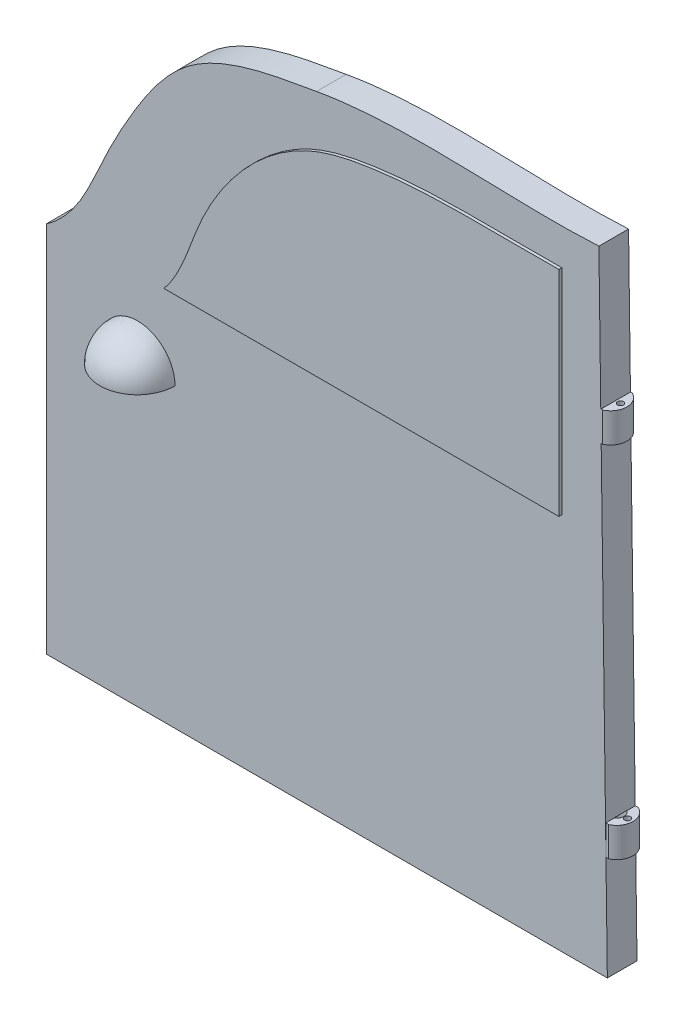
ISO-10303-21;
HEADER;
FILE_DESCRIPTION(('STEP AP214'),'2;1');
FILE_NAME('part.step','',(''),(''),'','','');
FILE_SCHEMA(('AUTOMOTIVE_DESIGN { 1 0 10303 214 1 1 1 1 }'));
ENDSEC;
DATA;
#1=APPLICATION_CONTEXT('core data for automotive mechanical design processes');
#2=APPLICATION_PROTOCOL_DEFINITION('international standard','automotive_design',2000,#1);
#3=PRODUCT_CONTEXT('',#1,'mechanical');
#4=PRODUCT('Part','Part','',(#3));
#5=PRODUCT_RELATED_PRODUCT_CATEGORY('part','',(#4));
#6=PRODUCT_DEFINITION_FORMATION('','',#4);
#7=PRODUCT_DEFINITION_CONTEXT('part definition',#1,'design');
#8=PRODUCT_DEFINITION('design','',#6,#7);
#9=PRODUCT_DEFINITION_SHAPE('','',#8);
#10=(LENGTH_UNIT() NAMED_UNIT(*) SI_UNIT(.MILLI.,.METRE.));
#11=(NAMED_UNIT(*) PLANE_ANGLE_UNIT() SI_UNIT($,.RADIAN.));
#12=(NAMED_UNIT(*) SI_UNIT($,.STERADIAN.) SOLID_ANGLE_UNIT());
#13=UNCERTAINTY_MEASURE_WITH_UNIT(LENGTH_MEASURE(1.E-05),#10,'distance_accuracy_value','');
#14=(GEOMETRIC_REPRESENTATION_CONTEXT(3) GLOBAL_UNCERTAINTY_ASSIGNED_CONTEXT((#13)) GLOBAL_UNIT_ASSIGNED_CONTEXT((#10,
#11,#12)) REPRESENTATION_CONTEXT('',''));
#15=CARTESIAN_POINT('',(0.,0.,0.));
#16=DIRECTION('',(0.,0.,1.));
#17=DIRECTION('',(1.,0.,0.));
#18=AXIS2_PLACEMENT_3D('',#15,#16,#17);
#19=CARTESIAN_POINT('',(188.575018149559,45.,0.));
#20=DIRECTION('',(1.,0.,0.));
#21=DIRECTION('',(0.,0.,-1.));
#22=AXIS2_PLACEMENT_3D('',#19,#20,#21);
#23=PLANE('',#22);
#24=DIRECTION('',(0.,0.,1.));
#25=VECTOR('',#24,1.);
#26=CARTESIAN_POINT('',(188.575018149559,41.1730352161484,10.));
#27=LINE('',#26,#25);
#28=CARTESIAN_POINT('',(188.575018149559,41.1730352161484,0.));
#29=VERTEX_POINT('',#28);
#30=CARTESIAN_POINT('',(188.575018149559,41.1730352161484,2.86242445380102));
#31=VERTEX_POINT('',#30);
#32=EDGE_CURVE('E263',#29,#31,#27,.T.);
#33=ORIENTED_EDGE('',*,*,#32,.T.);
#34=DIRECTION('',(0.,1.,0.));
#35=VECTOR('',#34,1.);
#36=CARTESIAN_POINT('',(188.575018149559,35.,2.86242445380102));
#37=LINE('',#36,#35);
#38=CARTESIAN_POINT('',(188.575018149559,45.,2.86242445380102));
#39=VERTEX_POINT('',#38);
#40=EDGE_CURVE('E382',#31,#39,#37,.T.);
#41=ORIENTED_EDGE('',*,*,#40,.T.);
#42=DIRECTION('',(0.,0.,1.));
#43=VECTOR('',#42,1.);
#44=CARTESIAN_POINT('',(188.575018149559,45.,0.));
#45=LINE('',#44,#43);
#46=CARTESIAN_POINT('',(188.575018149559,45.,0.));
#47=VERTEX_POINT('',#46);
#48=EDGE_CURVE('E300',#47,#39,#45,.T.);
#49=ORIENTED_EDGE('',*,*,#48,.F.);
#50=DIRECTION('',(0.,-1.,0.));
#51=VECTOR('',#50,1.);
#52=CARTESIAN_POINT('',(188.575018149559,45.,0.));
#53=LINE('',#52,#51);
#54=EDGE_CURVE('E286',#47,#29,#53,.T.);
#55=ORIENTED_EDGE('',*,*,#54,.T.);
#56=EDGE_LOOP('',(#33,#41,#49,#55));
#57=FACE_BOUND('',#56,.T.);
#58=ADVANCED_FACE('F53',(#57),#23,.F.);
#59=CARTESIAN_POINT('',(186.280110434595,212.216863760996,10.));
#60=DIRECTION('',(-0.999910003212435,-0.0134158665656854,0.));
#61=DIRECTION('',(0.0134158665656854,-0.999910003212435,0.));
#62=AXIS2_PLACEMENT_3D('',#59,#60,#61);
#63=PLANE('',#62);
#64=DIRECTION('',(0.,0.,1.));
#65=VECTOR('',#64,1.);
#66=CARTESIAN_POINT('',(186.972854643501,160.585322797063,10.));
#67=LINE('',#66,#65);
#68=CARTESIAN_POINT('',(186.972854643501,160.585322797063,0.));
#69=VERTEX_POINT('',#68);
#70=CARTESIAN_POINT('',(186.972854643501,160.585322797063,10.));
#71=VERTEX_POINT('',#70);
#72=EDGE_CURVE('E314',#69,#71,#67,.T.);
#73=ORIENTED_EDGE('',*,*,#72,.F.);
#74=DIRECTION('',(-0.0134158665656854,0.999910003212435,0.));
#75=VECTOR('',#74,1.);
#76=CARTESIAN_POINT('',(186.280110434595,212.216863760996,0.));
#77=LINE('',#76,#75);
#78=CARTESIAN_POINT('',(186.280110434595,212.216863760996,0.));
#79=VERTEX_POINT('',#78);
#80=EDGE_CURVE('E601',#69,#79,#77,.T.);
#81=ORIENTED_EDGE('',*,*,#80,.T.);
#82=DIRECTION('',(0.,0.,-1.));
#83=VECTOR('',#82,1.);
#84=CARTESIAN_POINT('',(186.280110434595,212.216863760996,10.));
#85=LINE('',#84,#83);
#86=CARTESIAN_POINT('',(186.280110434595,212.216863760996,10.));
#87=VERTEX_POINT('',#86);
#88=EDGE_CURVE('E576',#87,#79,#85,.T.);
#89=ORIENTED_EDGE('',*,*,#88,.F.);
#90=DIRECTION('',(-0.0134158665656854,0.999910003212435,0.));
#91=VECTOR('',#90,1.);
#92=CARTESIAN_POINT('',(186.280110434595,212.216863760996,10.));
#93=LINE('',#92,#91);
#94=EDGE_CURVE('E571',#71,#87,#93,.T.);
#95=ORIENTED_EDGE('',*,*,#94,.F.);
#96=EDGE_LOOP('',(#73,#81,#89,#95));
#97=FACE_BOUND('',#96,.T.);
#98=ADVANCED_FACE('F537',(#97),#63,.F.);
#99=DIRECTION('',(0.,0.,-1.));
#100=VECTOR('',#99,1.);
#101=CARTESIAN_POINT('',(188.523671479632,45.,10.));
#102=LINE('',#101,#100);
#103=CARTESIAN_POINT('',(188.523671479632,45.,7.14911649207953));
#104=VERTEX_POINT('',#103);
#105=CARTESIAN_POINT('',(188.523671479632,45.,2.83160382744635));
#106=VERTEX_POINT('',#105);
#107=EDGE_CURVE('E375',#104,#106,#102,.T.);
#108=ORIENTED_EDGE('',*,*,#107,.T.);
#109=CARTESIAN_POINT('',(187.26281022728,138.974382699553,4.99036015976294));
#110=DIRECTION('',(-0.999910003212435,-0.0134158665656854,0.));
#111=DIRECTION('',(-0.0134158665656854,0.999910003212435,0.));
#112=AXIS2_PLACEMENT_3D('',#109,#110,#111);
#113=ELLIPSE('',#112,186.346516474337,2.5);
#114=EDGE_CURVE('E381',#106,#31,#113,.T.);
#115=ORIENTED_EDGE('',*,*,#114,.T.);
#116=ORIENTED_EDGE('',*,*,#32,.F.);
#117=CARTESIAN_POINT('',(187.047793333114,155.,0.));
#118=VERTEX_POINT('',#117);
#119=EDGE_CURVE('E605',#29,#118,#77,.T.);
#120=ORIENTED_EDGE('',*,*,#119,.T.);
#121=DIRECTION('',(0.,0.,-1.));
#122=VECTOR('',#121,1.);
#123=CARTESIAN_POINT('',(187.047793333114,155.,10.));
#124=LINE('',#123,#122);
#125=CARTESIAN_POINT('',(187.047793333114,155.,10.));
#126=VERTEX_POINT('',#125);
#127=EDGE_CURVE('E318',#126,#118,#124,.T.);
#128=ORIENTED_EDGE('',*,*,#127,.F.);
#129=CARTESIAN_POINT('',(189.127439812298,0.,10.));
#130=VERTEX_POINT('',#129);
#131=EDGE_CURVE('E572',#130,#126,#93,.T.);
#132=ORIENTED_EDGE('',*,*,#131,.F.);
#133=DIRECTION('',(0.,0.,-1.));
#134=VECTOR('',#133,1.);
#135=CARTESIAN_POINT('',(189.127439812298,0.,10.));
#136=LINE('',#135,#134);
#137=CARTESIAN_POINT('',(189.127439812298,0.,0.));
#138=VERTEX_POINT('',#137);
#139=EDGE_CURVE('E609',#130,#138,#136,.T.);
#140=ORIENTED_EDGE('',*,*,#139,.T.);
#141=CARTESIAN_POINT('',(188.657842220224,35.,0.));
#142=VERTEX_POINT('',#141);
#143=EDGE_CURVE('E602',#138,#142,#77,.T.);
#144=ORIENTED_EDGE('',*,*,#143,.T.);
#145=DIRECTION('',(0.,0.,-1.));
#146=VECTOR('',#145,1.);
#147=CARTESIAN_POINT('',(188.657842220224,35.,10.));
#148=LINE('',#147,#146);
#149=CARTESIAN_POINT('',(188.657842220224,35.,2.91577930121322));
#150=VERTEX_POINT('',#149);
#151=EDGE_CURVE('E251',#150,#142,#148,.T.);
#152=ORIENTED_EDGE('',*,*,#151,.F.);
#153=CARTESIAN_POINT('',(188.657842220224,35.,7.06494101831266));
#154=VERTEX_POINT('',#153);
#155=EDGE_CURVE('E233',#154,#150,#148,.T.);
#156=ORIENTED_EDGE('',*,*,#155,.F.);
#157=CARTESIAN_POINT('',(188.657842220224,35.,9.98072031952588));
#158=VERTEX_POINT('',#157);
#159=EDGE_CURVE('E248',#158,#154,#148,.T.);
#160=ORIENTED_EDGE('',*,*,#159,.F.);
#161=DIRECTION('',(0.0134158665656854,-0.999910003212435,0.));
#162=VECTOR('',#161,1.);
#163=CARTESIAN_POINT('',(186.280110434595,212.216863760996,9.98072031952588));
#164=LINE('',#163,#162);
#165=CARTESIAN_POINT('',(188.575018149559,41.1730352161485,9.98072031952588));
#166=VERTEX_POINT('',#165);
#167=EDGE_CURVE('E63',#166,#158,#164,.T.);
#168=ORIENTED_EDGE('',*,*,#167,.F.);
#169=CARTESIAN_POINT('',(188.575018149559,41.1730352161484,7.11829586572486));
#170=VERTEX_POINT('',#169);
#171=EDGE_CURVE('E259',#170,#166,#27,.T.);
#172=ORIENTED_EDGE('',*,*,#171,.F.);
#173=EDGE_CURVE('E386',#170,#104,#113,.T.);
#174=ORIENTED_EDGE('',*,*,#173,.T.);
#175=EDGE_LOOP('',(#108,#115,#116,#120,#128,#132,#140,#144,#152,#156,#160,#168,#172,#174));
#176=FACE_BOUND('',#175,.T.);
#177=ADVANCED_FACE('F246',(#176),#63,.F.);
#178=CARTESIAN_POINT('',(30.7560478054073,100.001165305243,10.));
#179=DIRECTION('',(0.,1.,0.));
#180=DIRECTION('',(-1.,0.,0.));
#181=AXIS2_PLACEMENT_3D('',#178,#179,#180);
#182=PLANE('',#181);
#183=CARTESIAN_POINT('',(30.8506889210458,100.001165305243,8.96371369657704));
#184=DIRECTION('',(0.,1.,0.));
#185=DIRECTION('',(0.,0.,1.));
#186=AXIS2_PLACEMENT_3D('',#183,#184,#185);
#187=CIRCLE('',#186,11.1136714335348);
#188=CARTESIAN_POINT('',(41.9159409936335,100.001165305243,10.));
#189=VERTEX_POINT('',#188);
#190=CARTESIAN_POINT('',(19.7854368484582,100.001165305243,9.99999999999999));
#191=VERTEX_POINT('',#190);
#192=EDGE_CURVE('E639',#189,#191,#187,.F.);
#193=ORIENTED_EDGE('',*,*,#192,.F.);
#194=DIRECTION('',(1.,0.,0.));
#195=VECTOR('',#194,1.);
#196=CARTESIAN_POINT('',(18.0990244994778,100.001165305243,9.99999999999999));
#197=LINE('',#196,#195);
#198=CARTESIAN_POINT('',(43.4130711113369,100.001165305243,9.99999999999999));
#199=VERTEX_POINT('',#198);
#200=EDGE_CURVE('E482',#189,#199,#197,.T.);
#201=ORIENTED_EDGE('',*,*,#200,.T.);
#202=CARTESIAN_POINT('',(30.7560478054073,100.001165305243,10.));
#203=DIRECTION('',(0.,-1.,0.));
#204=DIRECTION('',(-1.,0.,0.));
#205=AXIS2_PLACEMENT_3D('',#202,#203,#204);
#206=CIRCLE('',#205,12.6570233059295);
#207=CARTESIAN_POINT('',(18.0990244994778,100.001165305243,10.));
#208=VERTEX_POINT('',#207);
#209=EDGE_CURVE('E479',#199,#208,#206,.T.);
#210=ORIENTED_EDGE('',*,*,#209,.T.);
#211=EDGE_CURVE('E483',#208,#191,#197,.T.);
#212=ORIENTED_EDGE('',*,*,#211,.T.);
#213=EDGE_LOOP('',(#193,#201,#210,#212));
#214=FACE_BOUND('',#213,.T.);
#215=ADVANCED_FACE('F529',(#214),#182,.F.);
#216=CARTESIAN_POINT('',(138.609555806472,212.457996663782,10.));
#217=DIRECTION('',(0.,0.,1.));
#218=DIRECTION('',(1.,0.,0.));
#219=AXIS2_PLACEMENT_3D('',#216,#217,#218);
#220=PLANE('',#219);
#221=ORIENTED_EDGE('',*,*,#131,.T.);
#222=DIRECTION('',(1.,0.,0.));
#223=VECTOR('',#222,1.);
#224=CARTESIAN_POINT('',(186.972854643501,155.,10.));
#225=LINE('',#224,#223);
#226=CARTESIAN_POINT('',(187.472854643501,155.,10.));
#227=VERTEX_POINT('',#226);
#228=EDGE_CURVE('E359',#126,#227,#225,.T.);
#229=ORIENTED_EDGE('',*,*,#228,.T.);
#230=DIRECTION('',(0.,-1.,0.));
#231=VECTOR('',#230,1.);
#232=CARTESIAN_POINT('',(187.472854643501,165.,10.));
#233=LINE('',#232,#231);
#234=CARTESIAN_POINT('',(187.472854643501,165.,10.));
#235=VERTEX_POINT('',#234);
#236=EDGE_CURVE('E326',#235,#227,#233,.T.);
#237=ORIENTED_EDGE('',*,*,#236,.F.);
#238=DIRECTION('',(1.,0.,0.));
#239=VECTOR('',#238,1.);
#240=CARTESIAN_POINT('',(186.972854643501,165.,10.));
#241=LINE('',#240,#239);
#242=CARTESIAN_POINT('',(186.972854643501,165.,10.));
#243=VERTEX_POINT('',#242);
#244=EDGE_CURVE('E345',#243,#235,#241,.T.);
#245=ORIENTED_EDGE('',*,*,#244,.F.);
#246=DIRECTION('',(0.,-1.,0.));
#247=VECTOR('',#246,1.);
#248=CARTESIAN_POINT('',(186.972854643501,165.,10.));
#249=LINE('',#248,#247);
#250=EDGE_CURVE('E322',#243,#71,#249,.T.);
#251=ORIENTED_EDGE('',*,*,#250,.T.);
#252=ORIENTED_EDGE('',*,*,#94,.T.);
#253=CARTESIAN_POINT('',(186.280110434595,212.216863760996,10.));
#254=CARTESIAN_POINT('',(154.601009659826,210.515513686985,10.));
#255=CARTESIAN_POINT('',(122.56511669544,215.374757588446,10.));
#256=CARTESIAN_POINT('',(91.0979569513852,209.776295722965,10.));
#257=B_SPLINE_CURVE_WITH_KNOTS('',3,(#253,#254,#255,#256),.UNSPECIFIED.,.F.,.F.,(4,4),(0.,1.),.UNSPECIFIED.);
#258=CARTESIAN_POINT('',(91.0979569513852,209.776295722965,10.));
#259=VERTEX_POINT('',#258);
#260=EDGE_CURVE('E558',#87,#259,#257,.T.);
#261=ORIENTED_EDGE('',*,*,#260,.T.);
#262=CARTESIAN_POINT('',(91.0979569513852,209.776295722965,10.));
#263=CARTESIAN_POINT('',(76.8678960286679,207.296992896224,10.));
#264=CARTESIAN_POINT('',(49.352217031208,203.040751330026,10.));
#265=CARTESIAN_POINT('',(30.538510920932,175.763388939779,10.));
#266=CARTESIAN_POINT('',(17.0981654853638,150.751131910875,10.));
#267=CARTESIAN_POINT('',(10.5570019054249,132.837635912411,10.));
#268=CARTESIAN_POINT('',(0.,125.576698410894,10.));
#269=B_SPLINE_CURVE_WITH_KNOTS('',3,(#262,#263,#264,#265,#266,#267,#268),.UNSPECIFIED.,.F.,.F.,
(4,1,1,1,4),(0.,0.344171163029158,0.573428409171298,0.724753948628638,1.),.UNSPECIFIED.);
#270=CARTESIAN_POINT('',(0.,125.576698410894,10.));
#271=VERTEX_POINT('',#270);
#272=EDGE_CURVE('E551',#259,#271,#269,.T.);
#273=ORIENTED_EDGE('',*,*,#272,.T.);
#274=DIRECTION('',(0.,-1.,0.));
#275=VECTOR('',#274,1.);
#276=CARTESIAN_POINT('',(0.,0.,10.));
#277=LINE('',#276,#275);
#278=CARTESIAN_POINT('',(0.,0.,10.));
#279=VERTEX_POINT('',#278);
#280=EDGE_CURVE('E557',#271,#279,#277,.T.);
#281=ORIENTED_EDGE('',*,*,#280,.T.);
#282=DIRECTION('',(1.,0.,0.));
#283=VECTOR('',#282,1.);
#284=CARTESIAN_POINT('',(189.127439812298,0.,10.));
#285=LINE('',#284,#283);
#286=EDGE_CURVE('E568',#279,#130,#285,.T.);
#287=ORIENTED_EDGE('',*,*,#286,.T.);
#288=EDGE_LOOP('',(#221,#229,#237,#245,#251,#252,#261,#273,#281,#287));
#289=FACE_BOUND('',#288,.T.);
#290=CARTESIAN_POINT('',(173.803726190315,199.679337800593,10.));
#291=CARTESIAN_POINT('',(152.264868916358,199.362802741396,10.));
#292=CARTESIAN_POINT('',(124.317503439642,201.038762955487,10.));
#293=CARTESIAN_POINT('',(78.4575076434082,191.212262770852,10.));
#294=CARTESIAN_POINT('',(53.3691343930654,161.704453989201,10.));
#295=CARTESIAN_POINT('',(46.7712903409994,134.93330682704,10.));
#296=CARTESIAN_POINT('',(40.691917072669,127.565231362125,10.));
#297=B_SPLINE_CURVE_WITH_KNOTS('',3,(#290,#291,#292,#293,#294,#295,#296),.UNSPECIFIED.,.F.,.F.,
(4,1,1,1,4),(0.,0.388400772627432,0.499498315224305,0.834382390259932,1.),.UNSPECIFIED.);
#298=CARTESIAN_POINT('',(173.803726190315,199.679337800593,10.));
#299=VERTEX_POINT('',#298);
#300=CARTESIAN_POINT('',(40.691917072669,127.565231362125,10.));
#301=VERTEX_POINT('',#300);
#302=EDGE_CURVE('E584',#299,#301,#297,.T.);
#303=ORIENTED_EDGE('',*,*,#302,.F.);
#304=DIRECTION('',(0.,1.,0.));
#305=VECTOR('',#304,1.);
#306=CARTESIAN_POINT('',(173.803726190315,212.457996663782,10.));
#307=LINE('',#306,#305);
#308=CARTESIAN_POINT('',(173.803726190315,127.565231362125,10.));
#309=VERTEX_POINT('',#308);
#310=EDGE_CURVE('E748',#309,#299,#307,.T.);
#311=ORIENTED_EDGE('',*,*,#310,.F.);
#312=DIRECTION('',(1.,0.,0.));
#313=VECTOR('',#312,1.);
#314=CARTESIAN_POINT('',(138.609555806472,127.565231362125,10.));
#315=LINE('',#314,#313);
#316=EDGE_CURVE('E744',#301,#309,#315,.T.);
#317=ORIENTED_EDGE('',*,*,#316,.F.);
#318=EDGE_LOOP('',(#303,#311,#317));
#319=FACE_BOUND('',#318,.T.);
#320=ORIENTED_EDGE('',*,*,#211,.F.);
#321=CARTESIAN_POINT('',(30.7560478054073,100.001165305243,10.));
#322=DIRECTION('',(0.,0.,1.));
#323=DIRECTION('',(-1.,0.,0.));
#324=AXIS2_PLACEMENT_3D('',#321,#322,#323);
#325=CIRCLE('',#324,12.6570233059295);
#326=EDGE_CURVE('E473',#199,#208,#325,.T.);
#327=ORIENTED_EDGE('',*,*,#326,.F.);
#328=ORIENTED_EDGE('',*,*,#200,.F.);
#329=CARTESIAN_POINT('',(30.8506889210458,98.9648790018205,9.99999999999999));
#330=DIRECTION('',(0.,0.,1.));
#331=DIRECTION('',(0.,1.,0.));
#332=AXIS2_PLACEMENT_3D('',#329,#330,#331);
#333=CIRCLE('',#332,11.1136714335348);
#334=EDGE_CURVE('E469',#189,#191,#333,.T.);
#335=ORIENTED_EDGE('',*,*,#334,.T.);
#336=EDGE_LOOP('',(#320,#327,#328,#335));
#337=FACE_BOUND('',#336,.T.);
#338=ADVANCED_FACE('F526',(#289,#319,#337),#220,.T.);
#339=DIRECTION('',(0.,0.,-1.));
#340=VECTOR('',#339,1.);
#341=SURFACE_OF_LINEAR_EXTRUSION('',#257,#340);
#342=CARTESIAN_POINT('',(186.280110434595,212.216863760996,0.));
#343=CARTESIAN_POINT('',(154.601009659826,210.515513686985,0.));
#344=CARTESIAN_POINT('',(122.56511669544,215.374757588446,0.));
#345=CARTESIAN_POINT('',(91.0979569513852,209.776295722965,0.));
#346=B_SPLINE_CURVE_WITH_KNOTS('',3,(#342,#343,#344,#345),.UNSPECIFIED.,.F.,.F.,(4,4),(0.,1.),.UNSPECIFIED.);
#347=CARTESIAN_POINT('',(91.0979569513852,209.776295722965,0.));
#348=VERTEX_POINT('',#347);
#349=EDGE_CURVE('E577',#79,#348,#346,.T.);
#350=ORIENTED_EDGE('',*,*,#349,.T.);
#351=DIRECTION('',(0.,0.,-1.));
#352=VECTOR('',#351,1.);
#353=CARTESIAN_POINT('',(91.0979569513852,209.776295722965,10.));
#354=LINE('',#353,#352);
#355=EDGE_CURVE('E621',#259,#348,#354,.T.);
#356=ORIENTED_EDGE('',*,*,#355,.F.);
#357=ORIENTED_EDGE('',*,*,#260,.F.);
#358=ORIENTED_EDGE('',*,*,#88,.T.);
#359=EDGE_LOOP('',(#350,#356,#357,#358));
#360=FACE_BOUND('',#359,.T.);
#361=ADVANCED_FACE('F55',(#360),#341,.F.);
#362=DIRECTION('',(0.,0.,-1.));
#363=VECTOR('',#362,1.);
#364=SURFACE_OF_LINEAR_EXTRUSION('',#269,#363);
#365=CARTESIAN_POINT('',(91.0979569513852,209.776295722965,0.));
#366=CARTESIAN_POINT('',(76.8678960286679,207.296992896224,0.));
#367=CARTESIAN_POINT('',(49.352217031208,203.040751330026,0.));
#368=CARTESIAN_POINT('',(30.538510920932,175.763388939779,0.));
#369=CARTESIAN_POINT('',(17.0981654853638,150.751131910875,0.));
#370=CARTESIAN_POINT('',(10.5570019054249,132.837635912411,0.));
#371=CARTESIAN_POINT('',(0.,125.576698410894,0.));
#372=B_SPLINE_CURVE_WITH_KNOTS('',3,(#365,#366,#367,#368,#369,#370,#371),.UNSPECIFIED.,.F.,.F.,
(4,1,1,1,4),(0.,0.344171163029158,0.573428409171298,0.724753948628638,1.),.UNSPECIFIED.);
#373=CARTESIAN_POINT('',(0.,125.576698410894,0.));
#374=VERTEX_POINT('',#373);
#375=EDGE_CURVE('E583',#348,#374,#372,.T.);
#376=ORIENTED_EDGE('',*,*,#375,.T.);
#377=DIRECTION('',(0.,0.,-1.));
#378=VECTOR('',#377,1.);
#379=CARTESIAN_POINT('',(0.,125.576698410894,10.));
#380=LINE('',#379,#378);
#381=EDGE_CURVE('E617',#271,#374,#380,.T.);
#382=ORIENTED_EDGE('',*,*,#381,.F.);
#383=ORIENTED_EDGE('',*,*,#272,.F.);
#384=ORIENTED_EDGE('',*,*,#355,.T.);
#385=EDGE_LOOP('',(#376,#382,#383,#384));
#386=FACE_BOUND('',#385,.T.);
#387=ADVANCED_FACE('F546',(#386),#364,.F.);
#388=CARTESIAN_POINT('',(0.,0.,10.));
#389=DIRECTION('',(1.,0.,0.));
#390=DIRECTION('',(0.,0.,-1.));
#391=AXIS2_PLACEMENT_3D('',#388,#389,#390);
#392=PLANE('',#391);
#393=DIRECTION('',(0.,-1.,0.));
#394=VECTOR('',#393,1.);
#395=CARTESIAN_POINT('',(0.,0.,0.));
#396=LINE('',#395,#394);
#397=CARTESIAN_POINT('',(0.,0.,0.));
#398=VERTEX_POINT('',#397);
#399=EDGE_CURVE('E592',#374,#398,#396,.T.);
#400=ORIENTED_EDGE('',*,*,#399,.T.);
#401=DIRECTION('',(0.,0.,-1.));
#402=VECTOR('',#401,1.);
#403=CARTESIAN_POINT('',(0.,0.,10.));
#404=LINE('',#403,#402);
#405=EDGE_CURVE('E613',#279,#398,#404,.T.);
#406=ORIENTED_EDGE('',*,*,#405,.F.);
#407=ORIENTED_EDGE('',*,*,#280,.F.);
#408=ORIENTED_EDGE('',*,*,#381,.T.);
#409=EDGE_LOOP('',(#400,#406,#407,#408));
#410=FACE_BOUND('',#409,.T.);
#411=ADVANCED_FACE('F543',(#410),#392,.F.);
#412=CARTESIAN_POINT('',(189.127439812298,0.,10.));
#413=DIRECTION('',(0.,1.,0.));
#414=DIRECTION('',(0.,0.,1.));
#415=AXIS2_PLACEMENT_3D('',#412,#413,#414);
#416=PLANE('',#415);
#417=DIRECTION('',(1.,0.,0.));
#418=VECTOR('',#417,1.);
#419=CARTESIAN_POINT('',(189.127439812298,0.,0.));
#420=LINE('',#419,#418);
#421=EDGE_CURVE('E598',#398,#138,#420,.T.);
#422=ORIENTED_EDGE('',*,*,#421,.T.);
#423=ORIENTED_EDGE('',*,*,#139,.F.);
#424=ORIENTED_EDGE('',*,*,#286,.F.);
#425=ORIENTED_EDGE('',*,*,#405,.T.);
#426=EDGE_LOOP('',(#422,#423,#424,#425));
#427=FACE_BOUND('',#426,.T.);
#428=ADVANCED_FACE('F535',(#427),#416,.F.);
#429=CARTESIAN_POINT('',(138.609555806472,212.457996663782,0.));
#430=DIRECTION('',(0.,0.,1.));
#431=DIRECTION('',(1.,0.,0.));
#432=AXIS2_PLACEMENT_3D('',#429,#430,#431);
#433=PLANE('',#432);
#434=ORIENTED_EDGE('',*,*,#80,.F.);
#435=DIRECTION('',(0.,-1.,0.));
#436=VECTOR('',#435,1.);
#437=CARTESIAN_POINT('',(186.972854643501,165.,0.));
#438=LINE('',#437,#436);
#439=CARTESIAN_POINT('',(186.972854643501,165.,0.));
#440=VERTEX_POINT('',#439);
#441=EDGE_CURVE('E334',#440,#69,#438,.T.);
#442=ORIENTED_EDGE('',*,*,#441,.F.);
#443=DIRECTION('',(1.,0.,0.));
#444=VECTOR('',#443,1.);
#445=CARTESIAN_POINT('',(186.972854643501,165.,0.));
#446=LINE('',#445,#444);
#447=CARTESIAN_POINT('',(187.472854643501,165.,0.));
#448=VERTEX_POINT('',#447);
#449=EDGE_CURVE('E338',#440,#448,#446,.T.);
#450=ORIENTED_EDGE('',*,*,#449,.T.);
#451=DIRECTION('',(0.,-1.,0.));
#452=VECTOR('',#451,1.);
#453=CARTESIAN_POINT('',(187.472854643501,165.,0.));
#454=LINE('',#453,#452);
#455=CARTESIAN_POINT('',(187.472854643501,155.,0.));
#456=VERTEX_POINT('',#455);
#457=EDGE_CURVE('E330',#448,#456,#454,.T.);
#458=ORIENTED_EDGE('',*,*,#457,.T.);
#459=DIRECTION('',(1.,0.,0.));
#460=VECTOR('',#459,1.);
#461=CARTESIAN_POINT('',(186.972854643501,155.,0.));
#462=LINE('',#461,#460);
#463=EDGE_CURVE('E352',#118,#456,#462,.T.);
#464=ORIENTED_EDGE('',*,*,#463,.F.);
#465=ORIENTED_EDGE('',*,*,#119,.F.);
#466=ORIENTED_EDGE('',*,*,#54,.F.);
#467=DIRECTION('',(1.,0.,0.));
#468=VECTOR('',#467,1.);
#469=CARTESIAN_POINT('',(188.575018149559,45.,0.));
#470=LINE('',#469,#468);
#471=CARTESIAN_POINT('',(189.575018149559,45.,0.));
#472=VERTEX_POINT('',#471);
#473=EDGE_CURVE('E290',#47,#472,#470,.T.);
#474=ORIENTED_EDGE('',*,*,#473,.T.);
#475=DIRECTION('',(0.,-1.,0.));
#476=VECTOR('',#475,1.);
#477=CARTESIAN_POINT('',(189.575018149559,45.,0.));
#478=LINE('',#477,#476);
#479=CARTESIAN_POINT('',(189.575018149559,35.,0.));
#480=VERTEX_POINT('',#479);
#481=EDGE_CURVE('E280',#472,#480,#478,.T.);
#482=ORIENTED_EDGE('',*,*,#481,.T.);
#483=DIRECTION('',(1.,0.,0.));
#484=VECTOR('',#483,1.);
#485=CARTESIAN_POINT('',(188.575018149559,35.,0.));
#486=LINE('',#485,#484);
#487=EDGE_CURVE('E305',#142,#480,#486,.T.);
#488=ORIENTED_EDGE('',*,*,#487,.F.);
#489=ORIENTED_EDGE('',*,*,#143,.F.);
#490=ORIENTED_EDGE('',*,*,#421,.F.);
#491=ORIENTED_EDGE('',*,*,#399,.F.);
#492=ORIENTED_EDGE('',*,*,#375,.F.);
#493=ORIENTED_EDGE('',*,*,#349,.F.);
#494=EDGE_LOOP('',(#434,#442,#450,#458,#464,#465,#466,#474,#482,#488,#489,#490,#491,#492,#493));
#495=FACE_BOUND('',#494,.T.);
#496=DIRECTION('',(0.,1.,0.));
#497=VECTOR('',#496,1.);
#498=CARTESIAN_POINT('',(173.803726190315,212.457996663782,0.));
#499=LINE('',#498,#497);
#500=CARTESIAN_POINT('',(173.803726190315,127.565231362125,0.));
#501=VERTEX_POINT('',#500);
#502=CARTESIAN_POINT('',(173.803726190315,199.679337800593,0.));
#503=VERTEX_POINT('',#502);
#504=EDGE_CURVE('E629',#501,#503,#499,.T.);
#505=ORIENTED_EDGE('',*,*,#504,.T.);
#506=CARTESIAN_POINT('',(173.803726190315,199.679337800593,0.));
#507=CARTESIAN_POINT('',(152.264868916358,199.362802741396,0.));
#508=CARTESIAN_POINT('',(124.317503439642,201.038762955487,0.));
#509=CARTESIAN_POINT('',(78.4575076434082,191.212262770852,0.));
#510=CARTESIAN_POINT('',(53.3691343930654,161.704453989201,0.));
#511=CARTESIAN_POINT('',(46.7712903409994,134.93330682704,0.));
#512=CARTESIAN_POINT('',(40.691917072669,127.565231362125,0.));
#513=B_SPLINE_CURVE_WITH_KNOTS('',3,(#506,#507,#508,#509,#510,#511,#512),.UNSPECIFIED.,.F.,.F.,
(4,1,1,1,4),(0.,0.388400772627432,0.499498315224305,0.834382390259932,1.),.UNSPECIFIED.);
#514=CARTESIAN_POINT('',(40.691917072669,127.565231362125,0.));
#515=VERTEX_POINT('',#514);
#516=EDGE_CURVE('E633',#503,#515,#513,.T.);
#517=ORIENTED_EDGE('',*,*,#516,.T.);
#518=DIRECTION('',(1.,0.,0.));
#519=VECTOR('',#518,1.);
#520=CARTESIAN_POINT('',(138.609555806472,127.565231362125,0.));
#521=LINE('',#520,#519);
#522=EDGE_CURVE('E625',#515,#501,#521,.T.);
#523=ORIENTED_EDGE('',*,*,#522,.T.);
#524=EDGE_LOOP('',(#505,#517,#523));
#525=FACE_BOUND('',#524,.T.);
#526=ADVANCED_FACE('F531',(#495,#525),#433,.F.);
#527=CARTESIAN_POINT('',(91.065816685106,192.807013880418,-1.));
#528=DIRECTION('',(0.,0.,-1.));
#529=DIRECTION('',(-1.,0.,0.));
#530=AXIS2_PLACEMENT_3D('',#527,#528,#529);
#531=PLANE('',#530);
#532=CARTESIAN_POINT('',(173.803726190315,199.679337800593,-1.));
#533=CARTESIAN_POINT('',(152.264868916358,199.362802741396,-1.));
#534=CARTESIAN_POINT('',(124.317503439642,201.038762955487,-1.));
#535=CARTESIAN_POINT('',(78.4575076434082,191.212262770852,-1.));
#536=CARTESIAN_POINT('',(53.3691343930654,161.704453989201,-1.));
#537=CARTESIAN_POINT('',(46.7712903409994,134.93330682704,-1.));
#538=CARTESIAN_POINT('',(40.691917072669,127.565231362125,-1.));
#539=B_SPLINE_CURVE_WITH_KNOTS('',3,(#532,#533,#534,#535,#536,#537,#538),.UNSPECIFIED.,.F.,.F.,
(4,1,1,1,4),(0.,0.388400772627432,0.499498315224305,0.834382390259932,1.),.UNSPECIFIED.);
#540=CARTESIAN_POINT('',(173.803726190315,199.679337800593,-1.));
#541=VERTEX_POINT('',#540);
#542=CARTESIAN_POINT('',(40.691917072669,127.565231362125,-1.));
#543=VERTEX_POINT('',#542);
#544=EDGE_CURVE('E504',#541,#543,#539,.T.);
#545=ORIENTED_EDGE('',*,*,#544,.F.);
#546=DIRECTION('',(0.,1.,0.));
#547=VECTOR('',#546,1.);
#548=CARTESIAN_POINT('',(173.803726190315,127.565231362125,-1.));
#549=LINE('',#548,#547);
#550=CARTESIAN_POINT('',(173.803726190315,127.565231362125,-1.));
#551=VERTEX_POINT('',#550);
#552=EDGE_CURVE('E741',#551,#541,#549,.T.);
#553=ORIENTED_EDGE('',*,*,#552,.F.);
#554=DIRECTION('',(1.,0.,0.));
#555=VECTOR('',#554,1.);
#556=CARTESIAN_POINT('',(40.691917072669,127.565231362125,-1.));
#557=LINE('',#556,#555);
#558=EDGE_CURVE('E511',#543,#551,#557,.T.);
#559=ORIENTED_EDGE('',*,*,#558,.F.);
#560=EDGE_LOOP('',(#545,#553,#559));
#561=FACE_BOUND('',#560,.T.);
#562=ADVANCED_FACE('F534',(#561),#531,.T.);
#563=CARTESIAN_POINT('',(40.691917072669,127.565231362125,-1.));
#564=DIRECTION('',(0.,-1.,0.));
#565=DIRECTION('',(0.,0.,-1.));
#566=AXIS2_PLACEMENT_3D('',#563,#564,#565);
#567=PLANE('',#566);
#568=ORIENTED_EDGE('',*,*,#522,.F.);
#569=DIRECTION('',(0.,0.,1.));
#570=VECTOR('',#569,1.);
#571=CARTESIAN_POINT('',(40.691917072669,127.565231362125,-1.));
#572=LINE('',#571,#570);
#573=EDGE_CURVE('E729',#543,#515,#572,.T.);
#574=ORIENTED_EDGE('',*,*,#573,.F.);
#575=ORIENTED_EDGE('',*,*,#558,.T.);
#576=DIRECTION('',(0.,0.,1.));
#577=VECTOR('',#576,1.);
#578=CARTESIAN_POINT('',(173.803726190315,127.565231362125,-1.));
#579=LINE('',#578,#577);
#580=EDGE_CURVE('E725',#551,#501,#579,.T.);
#581=ORIENTED_EDGE('',*,*,#580,.T.);
#582=EDGE_LOOP('',(#568,#574,#575,#581));
#583=FACE_BOUND('',#582,.T.);
#584=ADVANCED_FACE('F704',(#583),#567,.T.);
#585=CARTESIAN_POINT('',(173.803726190315,127.565231362125,-1.));
#586=DIRECTION('',(1.,0.,0.));
#587=DIRECTION('',(0.,0.,-1.));
#588=AXIS2_PLACEMENT_3D('',#585,#586,#587);
#589=PLANE('',#588);
#590=ORIENTED_EDGE('',*,*,#504,.F.);
#591=ORIENTED_EDGE('',*,*,#580,.F.);
#592=ORIENTED_EDGE('',*,*,#552,.T.);
#593=DIRECTION('',(0.,0.,1.));
#594=VECTOR('',#593,1.);
#595=CARTESIAN_POINT('',(173.803726190315,199.679337800593,-1.));
#596=LINE('',#595,#594);
#597=EDGE_CURVE('E727',#541,#503,#596,.T.);
#598=ORIENTED_EDGE('',*,*,#597,.T.);
#599=EDGE_LOOP('',(#590,#591,#592,#598));
#600=FACE_BOUND('',#599,.T.);
#601=ADVANCED_FACE('F708',(#600),#589,.T.);
#602=DIRECTION('',(0.,0.,1.));
#603=VECTOR('',#602,1.);
#604=SURFACE_OF_LINEAR_EXTRUSION('',#539,#603);
#605=ORIENTED_EDGE('',*,*,#516,.F.);
#606=ORIENTED_EDGE('',*,*,#597,.F.);
#607=ORIENTED_EDGE('',*,*,#544,.T.);
#608=ORIENTED_EDGE('',*,*,#573,.T.);
#609=EDGE_LOOP('',(#605,#606,#607,#608));
#610=FACE_BOUND('',#609,.T.);
#611=ADVANCED_FACE('F522',(#610),#604,.T.);
#612=CARTESIAN_POINT('',(173.803726190315,199.679337800593,11.));
#613=VERTEX_POINT('',#612);
#614=EDGE_CURVE('E764',#299,#613,#596,.T.);
#615=ORIENTED_EDGE('',*,*,#614,.F.);
#616=ORIENTED_EDGE('',*,*,#302,.T.);
#617=CARTESIAN_POINT('',(40.691917072669,127.565231362125,11.));
#618=VERTEX_POINT('',#617);
#619=EDGE_CURVE('E734',#301,#618,#572,.T.);
#620=ORIENTED_EDGE('',*,*,#619,.T.);
#621=CARTESIAN_POINT('',(173.803726190315,199.679337800593,11.));
#622=CARTESIAN_POINT('',(152.264868916358,199.362802741396,11.));
#623=CARTESIAN_POINT('',(124.317503439642,201.038762955487,11.));
#624=CARTESIAN_POINT('',(78.4575076434082,191.212262770852,11.));
#625=CARTESIAN_POINT('',(53.3691343930654,161.704453989201,11.));
#626=CARTESIAN_POINT('',(46.7712903409994,134.93330682704,11.));
#627=CARTESIAN_POINT('',(40.691917072669,127.565231362125,11.));
#628=B_SPLINE_CURVE_WITH_KNOTS('',3,(#621,#622,#623,#624,#625,#626,#627),.UNSPECIFIED.,.F.,.F.,
(4,1,1,1,4),(0.,0.388400772627432,0.499498315224305,0.834382390259932,1.),.UNSPECIFIED.);
#629=EDGE_CURVE('E487',#613,#618,#628,.T.);
#630=ORIENTED_EDGE('',*,*,#629,.F.);
#631=EDGE_LOOP('',(#615,#616,#620,#630));
#632=FACE_BOUND('',#631,.T.);
#633=ADVANCED_FACE('F517',(#632),#604,.T.);
#634=CARTESIAN_POINT('',(173.803726190315,127.565231362125,11.));
#635=VERTEX_POINT('',#634);
#636=EDGE_CURVE('E733',#309,#635,#579,.T.);
#637=ORIENTED_EDGE('',*,*,#636,.F.);
#638=ORIENTED_EDGE('',*,*,#310,.T.);
#639=ORIENTED_EDGE('',*,*,#614,.T.);
#640=DIRECTION('',(0.,1.,0.));
#641=VECTOR('',#640,1.);
#642=CARTESIAN_POINT('',(173.803726190315,127.565231362125,11.));
#643=LINE('',#642,#641);
#644=EDGE_CURVE('E500',#635,#613,#643,.T.);
#645=ORIENTED_EDGE('',*,*,#644,.F.);
#646=EDGE_LOOP('',(#637,#638,#639,#645));
#647=FACE_BOUND('',#646,.T.);
#648=ADVANCED_FACE('F521',(#647),#589,.T.);
#649=ORIENTED_EDGE('',*,*,#619,.F.);
#650=ORIENTED_EDGE('',*,*,#316,.T.);
#651=ORIENTED_EDGE('',*,*,#636,.T.);
#652=DIRECTION('',(1.,0.,0.));
#653=VECTOR('',#652,1.);
#654=CARTESIAN_POINT('',(40.691917072669,127.565231362125,11.));
#655=LINE('',#654,#653);
#656=EDGE_CURVE('E493',#618,#635,#655,.T.);
#657=ORIENTED_EDGE('',*,*,#656,.F.);
#658=EDGE_LOOP('',(#649,#650,#651,#657));
#659=FACE_BOUND('',#658,.T.);
#660=ADVANCED_FACE('F524',(#659),#567,.T.);
#661=CARTESIAN_POINT('',(91.065816685106,192.807013880418,11.));
#662=DIRECTION('',(0.,0.,-1.));
#663=DIRECTION('',(-1.,0.,0.));
#664=AXIS2_PLACEMENT_3D('',#661,#662,#663);
#665=PLANE('',#664);
#666=ORIENTED_EDGE('',*,*,#629,.T.);
#667=ORIENTED_EDGE('',*,*,#656,.T.);
#668=ORIENTED_EDGE('',*,*,#644,.T.);
#669=EDGE_LOOP('',(#666,#667,#668));
#670=FACE_BOUND('',#669,.T.);
#671=ADVANCED_FACE('F698',(#670),#665,.F.);
#672=CARTESIAN_POINT('',(30.7560478054073,100.001165305243,10.));
#673=DIRECTION('',(-1.,0.,0.));
#674=DIRECTION('',(0.,0.,-1.));
#675=AXIS2_PLACEMENT_3D('',#672,#673,#674);
#676=SPHERICAL_SURFACE('',#675,12.6570233059295);
#677=ORIENTED_EDGE('',*,*,#326,.T.);
#678=ORIENTED_EDGE('',*,*,#209,.F.);
#679=EDGE_LOOP('',(#677,#678));
#680=FACE_BOUND('',#679,.T.);
#681=ADVANCED_FACE('F691',(#680),#676,.T.);
#682=CARTESIAN_POINT('',(30.8506889210458,100.001165305243,8.96371369657704));
#683=DIRECTION('',(0.,-1.,0.));
#684=DIRECTION('',(0.,0.,1.));
#685=AXIS2_PLACEMENT_3D('',#682,#683,#684);
#686=CIRCLE('',#685,11.1136714335348);
#687=TRIMMED_CURVE('',#686,(PARAMETER_VALUE(-1.47741639559686)),
(PARAMETER_VALUE(1.47741639559686)),.T.,.PARAMETER.);
#688=CARTESIAN_POINT('',(30.8506889210458,100.001165305243,10.));
#689=DIRECTION('',(-1.,0.,0.));
#690=AXIS1_PLACEMENT('',#688,#689);
#691=SURFACE_OF_REVOLUTION('',#687,#690);
#692=ORIENTED_EDGE('',*,*,#192,.T.);
#693=ORIENTED_EDGE('',*,*,#334,.F.);
#694=EDGE_LOOP('',(#692,#693));
#695=FACE_BOUND('',#694,.T.);
#696=ADVANCED_FACE('F688',(#695),#691,.F.);
#697=CARTESIAN_POINT('',(188.575018149559,45.,9.98072031952588));
#698=DIRECTION('',(0.,0.,-1.));
#699=DIRECTION('',(-1.,0.,0.));
#700=AXIS2_PLACEMENT_3D('',#697,#698,#699);
#701=PLANE('',#700);
#702=DIRECTION('',(0.,-1.,0.));
#703=VECTOR('',#702,1.);
#704=CARTESIAN_POINT('',(188.575018149559,45.,9.98072031952588));
#705=LINE('',#704,#703);
#706=CARTESIAN_POINT('',(188.575018149559,45.,9.98072031952588));
#707=VERTEX_POINT('',#706);
#708=EDGE_CURVE('E267',#707,#166,#705,.T.);
#709=ORIENTED_EDGE('',*,*,#708,.T.);
#710=ORIENTED_EDGE('',*,*,#167,.T.);
#711=DIRECTION('',(1.,0.,0.));
#712=VECTOR('',#711,1.);
#713=CARTESIAN_POINT('',(188.575018149559,35.,9.98072031952588));
#714=LINE('',#713,#712);
#715=CARTESIAN_POINT('',(189.575018149559,35.,9.98072031952588));
#716=VERTEX_POINT('',#715);
#717=EDGE_CURVE('E257',#158,#716,#714,.T.);
#718=ORIENTED_EDGE('',*,*,#717,.T.);
#719=DIRECTION('',(0.,-1.,0.));
#720=VECTOR('',#719,1.);
#721=CARTESIAN_POINT('',(189.575018149559,45.,9.98072031952588));
#722=LINE('',#721,#720);
#723=CARTESIAN_POINT('',(189.575018149559,45.,9.98072031952588));
#724=VERTEX_POINT('',#723);
#725=EDGE_CURVE('E272',#724,#716,#722,.T.);
#726=ORIENTED_EDGE('',*,*,#725,.F.);
#727=DIRECTION('',(1.,0.,0.));
#728=VECTOR('',#727,1.);
#729=CARTESIAN_POINT('',(188.575018149559,45.,9.98072031952588));
#730=LINE('',#729,#728);
#731=EDGE_CURVE('E297',#707,#724,#730,.T.);
#732=ORIENTED_EDGE('',*,*,#731,.F.);
#733=EDGE_LOOP('',(#709,#710,#718,#726,#732));
#734=FACE_BOUND('',#733,.T.);
#735=ADVANCED_FACE('F648',(#734),#701,.F.);
#736=CARTESIAN_POINT('',(188.575018149559,45.,7.11829586572486));
#737=VERTEX_POINT('',#736);
#738=EDGE_CURVE('E304',#737,#707,#45,.T.);
#739=ORIENTED_EDGE('',*,*,#738,.F.);
#740=DIRECTION('',(0.,1.,0.));
#741=VECTOR('',#740,1.);
#742=CARTESIAN_POINT('',(188.575018149559,35.,7.11829586572486));
#743=LINE('',#742,#741);
#744=EDGE_CURVE('E76',#737,#170,#743,.F.);
#745=ORIENTED_EDGE('',*,*,#744,.T.);
#746=ORIENTED_EDGE('',*,*,#171,.T.);
#747=ORIENTED_EDGE('',*,*,#708,.F.);
#748=EDGE_LOOP('',(#739,#745,#746,#747));
#749=FACE_BOUND('',#748,.T.);
#750=ADVANCED_FACE('F402',(#749),#23,.F.);
#751=CARTESIAN_POINT('',(187.26281022728,35.,4.99036015976294));
#752=DIRECTION('',(0.,1.,0.));
#753=DIRECTION('',(0.,0.,1.));
#754=AXIS2_PLACEMENT_3D('',#751,#752,#753);
#755=PLANE('',#754);
#756=CARTESIAN_POINT('',(190.945125019789,35.,4.99518007988147));
#757=DIRECTION('',(0.,-1.,0.));
#758=DIRECTION('',(0.,0.,-1.));
#759=AXIS2_PLACEMENT_3D('',#756,#757,#758);
#760=CIRCLE('',#759,0.999999999999998);
#761=CARTESIAN_POINT('',(190.945125019789,35.,3.99518007988147));
#762=VERTEX_POINT('',#761);
#763=EDGE_CURVE('E371',#762,#762,#760,.T.);
#764=ORIENTED_EDGE('',*,*,#763,.F.);
#765=EDGE_LOOP('',(#764));
#766=FACE_BOUND('',#765,.T.);
#767=ORIENTED_EDGE('',*,*,#159,.T.);
#768=CARTESIAN_POINT('',(187.26281022728,35.,4.99036015976294));
#769=DIRECTION('',(0.,1.,0.));
#770=DIRECTION('',(0.,0.,1.));
#771=AXIS2_PLACEMENT_3D('',#768,#769,#770);
#772=CIRCLE('',#771,2.5);
#773=EDGE_CURVE('E236',#154,#150,#772,.T.);
#774=ORIENTED_EDGE('',*,*,#773,.T.);
#775=ORIENTED_EDGE('',*,*,#151,.T.);
#776=ORIENTED_EDGE('',*,*,#487,.T.);
#777=CARTESIAN_POINT('',(187.26281022728,35.,4.99036015976294));
#778=DIRECTION('',(0.,1.,0.));
#779=DIRECTION('',(0.,0.,1.));
#780=AXIS2_PLACEMENT_3D('',#777,#778,#779);
#781=CIRCLE('',#780,5.5);
#782=EDGE_CURVE('E308',#716,#480,#781,.T.);
#783=ORIENTED_EDGE('',*,*,#782,.F.);
#784=ORIENTED_EDGE('',*,*,#717,.F.);
#785=EDGE_LOOP('',(#767,#774,#775,#776,#783,#784));
#786=FACE_BOUND('',#785,.T.);
#787=ADVANCED_FACE('F255',(#766,#786),#755,.F.);
#788=CARTESIAN_POINT('',(187.26281022728,45.,4.99036015976294));
#789=DIRECTION('',(0.,-1.,0.));
#790=DIRECTION('',(0.,0.,-1.));
#791=AXIS2_PLACEMENT_3D('',#788,#789,#790);
#792=CYLINDRICAL_SURFACE('',#791,5.5);
#793=ORIENTED_EDGE('',*,*,#725,.T.);
#794=ORIENTED_EDGE('',*,*,#782,.T.);
#795=ORIENTED_EDGE('',*,*,#481,.F.);
#796=CARTESIAN_POINT('',(187.26281022728,45.,4.99036015976294));
#797=DIRECTION('',(0.,1.,0.));
#798=DIRECTION('',(0.,0.,1.));
#799=AXIS2_PLACEMENT_3D('',#796,#797,#798);
#800=CIRCLE('',#799,5.5);
#801=EDGE_CURVE('E294',#724,#472,#800,.T.);
#802=ORIENTED_EDGE('',*,*,#801,.F.);
#803=EDGE_LOOP('',(#793,#794,#795,#802));
#804=FACE_BOUND('',#803,.T.);
#805=ADVANCED_FACE('F652',(#804),#792,.T.);
#806=CARTESIAN_POINT('',(187.26281022728,45.,4.99036015976294));
#807=DIRECTION('',(0.,1.,0.));
#808=DIRECTION('',(0.,0.,1.));
#809=AXIS2_PLACEMENT_3D('',#806,#807,#808);
#810=PLANE('',#809);
#811=CARTESIAN_POINT('',(187.26281022728,45.,4.99036015976294));
#812=DIRECTION('',(0.,1.,0.));
#813=DIRECTION('',(0.,0.,1.));
#814=AXIS2_PLACEMENT_3D('',#811,#812,#813);
#815=CIRCLE('',#814,2.5);
#816=EDGE_CURVE('E11',#737,#39,#815,.T.);
#817=ORIENTED_EDGE('',*,*,#816,.F.);
#818=ORIENTED_EDGE('',*,*,#738,.T.);
#819=ORIENTED_EDGE('',*,*,#731,.T.);
#820=ORIENTED_EDGE('',*,*,#801,.T.);
#821=ORIENTED_EDGE('',*,*,#473,.F.);
#822=ORIENTED_EDGE('',*,*,#48,.T.);
#823=EDGE_LOOP('',(#817,#818,#819,#820,#821,#822));
#824=FACE_BOUND('',#823,.T.);
#825=CARTESIAN_POINT('',(190.945125019789,45.,4.99518007988147));
#826=DIRECTION('',(0.,-1.,0.));
#827=DIRECTION('',(0.,0.,-1.));
#828=AXIS2_PLACEMENT_3D('',#825,#826,#827);
#829=CIRCLE('',#828,0.999999999999998);
#830=CARTESIAN_POINT('',(190.945125019789,45.,3.99518007988147));
#831=VERTEX_POINT('',#830);
#832=EDGE_CURVE('E367',#831,#831,#829,.T.);
#833=ORIENTED_EDGE('',*,*,#832,.T.);
#834=EDGE_LOOP('',(#833));
#835=FACE_BOUND('',#834,.T.);
#836=ADVANCED_FACE('F659',(#824,#835),#810,.T.);
#837=CARTESIAN_POINT('',(186.972854643501,165.,0.));
#838=DIRECTION('',(1.,0.,0.));
#839=DIRECTION('',(0.,0.,-1.));
#840=AXIS2_PLACEMENT_3D('',#837,#838,#839);
#841=PLANE('',#840);
#842=ORIENTED_EDGE('',*,*,#441,.T.);
#843=ORIENTED_EDGE('',*,*,#72,.T.);
#844=ORIENTED_EDGE('',*,*,#250,.F.);
#845=DIRECTION('',(0.,0.,1.));
#846=VECTOR('',#845,1.);
#847=CARTESIAN_POINT('',(186.972854643501,165.,0.));
#848=LINE('',#847,#846);
#849=EDGE_CURVE('E348',#440,#243,#848,.T.);
#850=ORIENTED_EDGE('',*,*,#849,.F.);
#851=EDGE_LOOP('',(#842,#843,#844,#850));
#852=FACE_BOUND('',#851,.T.);
#853=ADVANCED_FACE('F662',(#852),#841,.F.);
#854=CARTESIAN_POINT('',(185.24705529274,155.,5.));
#855=DIRECTION('',(0.,1.,0.));
#856=DIRECTION('',(0.,0.,1.));
#857=AXIS2_PLACEMENT_3D('',#854,#855,#856);
#858=PLANE('',#857);
#859=CARTESIAN_POINT('',(188.575018149559,155.,5.));
#860=DIRECTION('',(0.,-1.,0.));
#861=DIRECTION('',(0.,0.,-1.));
#862=AXIS2_PLACEMENT_3D('',#859,#860,#861);
#863=CIRCLE('',#862,0.999999999999998);
#864=CARTESIAN_POINT('',(188.575018149559,155.,4.));
#865=VERTEX_POINT('',#864);
#866=EDGE_CURVE('E363',#865,#865,#863,.T.);
#867=ORIENTED_EDGE('',*,*,#866,.F.);
#868=EDGE_LOOP('',(#867));
#869=FACE_BOUND('',#868,.T.);
#870=ORIENTED_EDGE('',*,*,#228,.F.);
#871=ORIENTED_EDGE('',*,*,#127,.T.);
#872=ORIENTED_EDGE('',*,*,#463,.T.);
#873=CARTESIAN_POINT('',(185.24705529274,155.,5.));
#874=DIRECTION('',(0.,1.,0.));
#875=DIRECTION('',(0.,0.,1.));
#876=AXIS2_PLACEMENT_3D('',#873,#874,#875);
#877=CIRCLE('',#876,5.47304145332818);
#878=EDGE_CURVE('E355',#227,#456,#877,.T.);
#879=ORIENTED_EDGE('',*,*,#878,.F.);
#880=EDGE_LOOP('',(#870,#871,#872,#879));
#881=FACE_BOUND('',#880,.T.);
#882=ADVANCED_FACE('F901',(#869,#881),#858,.F.);
#883=CARTESIAN_POINT('',(185.24705529274,165.,5.));
#884=DIRECTION('',(0.,-1.,0.));
#885=DIRECTION('',(0.,0.,-1.));
#886=AXIS2_PLACEMENT_3D('',#883,#884,#885);
#887=CYLINDRICAL_SURFACE('',#886,5.47304145332818);
#888=ORIENTED_EDGE('',*,*,#236,.T.);
#889=ORIENTED_EDGE('',*,*,#878,.T.);
#890=ORIENTED_EDGE('',*,*,#457,.F.);
#891=CARTESIAN_POINT('',(185.24705529274,165.,5.));
#892=DIRECTION('',(0.,1.,0.));
#893=DIRECTION('',(0.,0.,1.));
#894=AXIS2_PLACEMENT_3D('',#891,#892,#893);
#895=CIRCLE('',#894,5.47304145332818);
#896=EDGE_CURVE('E342',#235,#448,#895,.T.);
#897=ORIENTED_EDGE('',*,*,#896,.F.);
#898=EDGE_LOOP('',(#888,#889,#890,#897));
#899=FACE_BOUND('',#898,.T.);
#900=ADVANCED_FACE('F905',(#899),#887,.T.);
#901=CARTESIAN_POINT('',(185.24705529274,165.,5.));
#902=DIRECTION('',(0.,1.,0.));
#903=DIRECTION('',(0.,0.,1.));
#904=AXIS2_PLACEMENT_3D('',#901,#902,#903);
#905=PLANE('',#904);
#906=CARTESIAN_POINT('',(188.575018149559,165.,5.));
#907=DIRECTION('',(0.,-1.,0.));
#908=DIRECTION('',(0.,0.,-1.));
#909=AXIS2_PLACEMENT_3D('',#906,#907,#908);
#910=CIRCLE('',#909,0.999999999999998);
#911=CARTESIAN_POINT('',(188.575018149559,165.,4.));
#912=VERTEX_POINT('',#911);
#913=EDGE_CURVE('E362',#912,#912,#910,.T.);
#914=ORIENTED_EDGE('',*,*,#913,.T.);
#915=EDGE_LOOP('',(#914));
#916=FACE_BOUND('',#915,.T.);
#917=ORIENTED_EDGE('',*,*,#849,.T.);
#918=ORIENTED_EDGE('',*,*,#244,.T.);
#919=ORIENTED_EDGE('',*,*,#896,.T.);
#920=ORIENTED_EDGE('',*,*,#449,.F.);
#921=EDGE_LOOP('',(#917,#918,#919,#920));
#922=FACE_BOUND('',#921,.T.);
#923=ADVANCED_FACE('F910',(#916,#922),#905,.T.);
#924=CARTESIAN_POINT('',(188.575018149559,165.,5.));
#925=DIRECTION('',(0.,-1.,0.));
#926=DIRECTION('',(0.,0.,-1.));
#927=AXIS2_PLACEMENT_3D('',#924,#925,#926);
#928=CYLINDRICAL_SURFACE('',#927,0.999999999999998);
#929=ORIENTED_EDGE('',*,*,#913,.F.);
#930=EDGE_LOOP('',(#929));
#931=FACE_BOUND('',#930,.T.);
#932=ORIENTED_EDGE('',*,*,#866,.T.);
#933=EDGE_LOOP('',(#932));
#934=FACE_BOUND('',#933,.T.);
#935=ADVANCED_FACE('F669',(#931,#934),#928,.F.);
#936=CARTESIAN_POINT('',(190.945125019789,45.,4.99518007988147));
#937=DIRECTION('',(0.,-1.,0.));
#938=DIRECTION('',(0.,0.,-1.));
#939=AXIS2_PLACEMENT_3D('',#936,#937,#938);
#940=CYLINDRICAL_SURFACE('',#939,0.999999999999998);
#941=ORIENTED_EDGE('',*,*,#832,.F.);
#942=EDGE_LOOP('',(#941));
#943=FACE_BOUND('',#942,.T.);
#944=ORIENTED_EDGE('',*,*,#763,.T.);
#945=EDGE_LOOP('',(#944));
#946=FACE_BOUND('',#945,.T.);
#947=ADVANCED_FACE('F666',(#943,#946),#940,.F.);
#948=CARTESIAN_POINT('',(187.26281022728,35.,4.99036015976294));
#949=DIRECTION('',(0.,1.,0.));
#950=DIRECTION('',(0.,0.,1.));
#951=AXIS2_PLACEMENT_3D('',#948,#949,#950);
#952=PLANE('',#951);
#953=ORIENTED_EDGE('',*,*,#155,.T.);
#954=EDGE_CURVE('E69',#150,#154,#772,.T.);
#955=ORIENTED_EDGE('',*,*,#954,.T.);
#956=EDGE_LOOP('',(#953,#955));
#957=FACE_BOUND('',#956,.T.);
#958=ADVANCED_FACE('F231',(#957),#952,.T.);
#959=CARTESIAN_POINT('',(187.26281022728,45.,4.99036015976294));
#960=DIRECTION('',(0.,1.,0.));
#961=DIRECTION('',(0.,0.,1.));
#962=AXIS2_PLACEMENT_3D('',#959,#960,#961);
#963=PLANE('',#962);
#964=CARTESIAN_POINT('',(187.26281022728,45.,4.99036015976294));
#965=DIRECTION('',(0.,1.,0.));
#966=DIRECTION('',(0.,0.,1.));
#967=AXIS2_PLACEMENT_3D('',#964,#965,#966);
#968=CIRCLE('',#967,2.5);
#969=EDGE_CURVE('E237',#106,#104,#968,.T.);
#970=ORIENTED_EDGE('',*,*,#969,.F.);
#971=ORIENTED_EDGE('',*,*,#107,.F.);
#972=EDGE_LOOP('',(#970,#971));
#973=FACE_BOUND('',#972,.T.);
#974=ADVANCED_FACE('F930',(#973),#963,.F.);
#975=CARTESIAN_POINT('',(187.26281022728,35.,4.99036015976294));
#976=DIRECTION('',(0.,1.,0.));
#977=DIRECTION('',(0.,0.,1.));
#978=AXIS2_PLACEMENT_3D('',#975,#976,#977);
#979=CYLINDRICAL_SURFACE('',#978,2.5);
#980=ORIENTED_EDGE('',*,*,#773,.F.);
#981=ORIENTED_EDGE('',*,*,#954,.F.);
#982=EDGE_LOOP('',(#980,#981));
#983=FACE_BOUND('',#982,.T.);
#984=ORIENTED_EDGE('',*,*,#969,.T.);
#985=ORIENTED_EDGE('',*,*,#173,.F.);
#986=ORIENTED_EDGE('',*,*,#744,.F.);
#987=ORIENTED_EDGE('',*,*,#816,.T.);
#988=ORIENTED_EDGE('',*,*,#40,.F.);
#989=ORIENTED_EDGE('',*,*,#114,.F.);
#990=EDGE_LOOP('',(#984,#985,#986,#987,#988,#989));
#991=FACE_BOUND('',#990,.T.);
#992=ADVANCED_FACE('F239',(#983,#991),#979,.F.);
#993=CLOSED_SHELL('',(#58,#98,#177,#215,#338,#361,#387,#411,#428,#526,#562,#584,#601,#611,#633,
#648,#660,#671,#681,#696,#735,#750,#787,#805,#836,#853,#882,#900,#923,#935,#947,#958,#974,#992));
#994=MANIFOLD_SOLID_BREP('B2',#993);
#995=ADVANCED_BREP_SHAPE_REPRESENTATION('',(#18,#994),#14);
#996=SHAPE_DEFINITION_REPRESENTATION(#9,#995);
ENDSEC;
END-ISO-10303-21;
